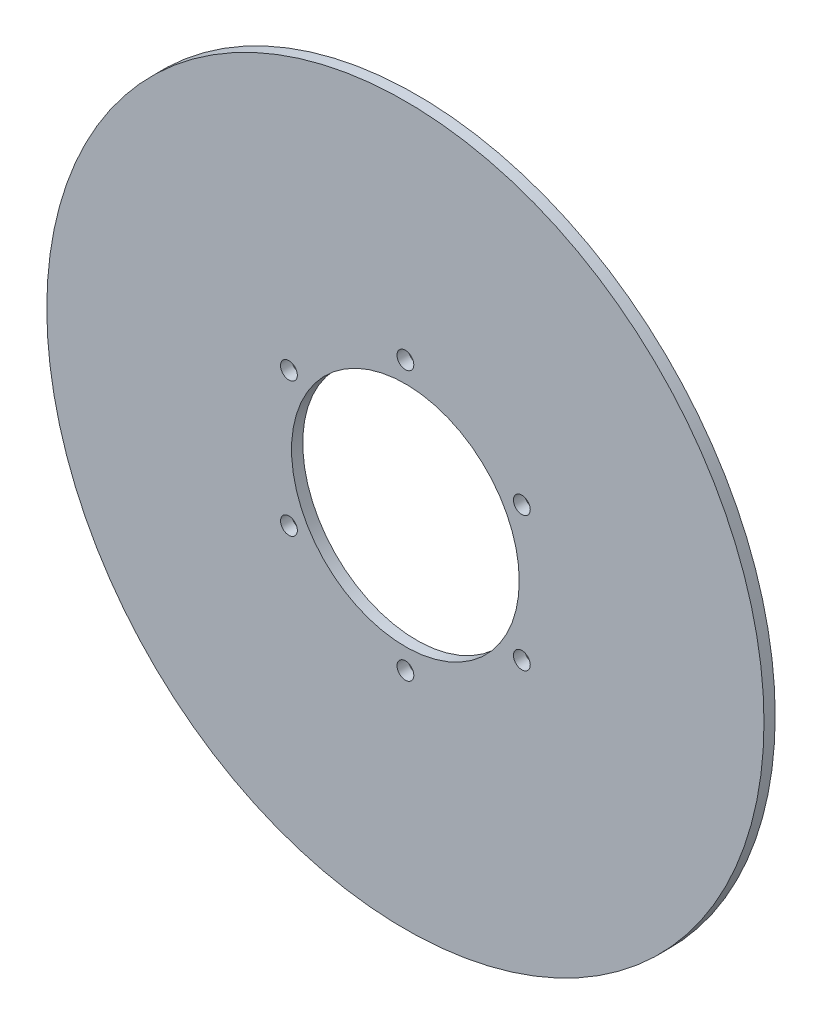
ISO-10303-21;
HEADER;
FILE_DESCRIPTION(('STEP AP214'),'2;1');
FILE_NAME('part.step','',(''),(''),'','','');
FILE_SCHEMA(('AUTOMOTIVE_DESIGN { 1 0 10303 214 1 1 1 1 }'));
ENDSEC;
DATA;
#1=APPLICATION_CONTEXT('core data for automotive mechanical design processes');
#2=APPLICATION_PROTOCOL_DEFINITION('international standard','automotive_design',2000,#1);
#3=PRODUCT_CONTEXT('',#1,'mechanical');
#4=PRODUCT('Part','Part','',(#3));
#5=PRODUCT_RELATED_PRODUCT_CATEGORY('part','',(#4));
#6=PRODUCT_DEFINITION_FORMATION('','',#4);
#7=PRODUCT_DEFINITION_CONTEXT('part definition',#1,'design');
#8=PRODUCT_DEFINITION('design','',#6,#7);
#9=PRODUCT_DEFINITION_SHAPE('','',#8);
#10=(LENGTH_UNIT() NAMED_UNIT(*) SI_UNIT(.MILLI.,.METRE.));
#11=(NAMED_UNIT(*) PLANE_ANGLE_UNIT() SI_UNIT($,.RADIAN.));
#12=(NAMED_UNIT(*) SI_UNIT($,.STERADIAN.) SOLID_ANGLE_UNIT());
#13=UNCERTAINTY_MEASURE_WITH_UNIT(LENGTH_MEASURE(1.E-05),#10,'distance_accuracy_value','');
#14=(GEOMETRIC_REPRESENTATION_CONTEXT(3) GLOBAL_UNCERTAINTY_ASSIGNED_CONTEXT((#13)) GLOBAL_UNIT_ASSIGNED_CONTEXT((#10,
#11,#12)) REPRESENTATION_CONTEXT('',''));
#15=CARTESIAN_POINT('',(0.,0.,0.));
#16=DIRECTION('',(0.,0.,1.));
#17=DIRECTION('',(1.,0.,0.));
#18=AXIS2_PLACEMENT_3D('',#15,#16,#17);
#19=CARTESIAN_POINT('',(0.,0.,1.5875));
#20=DIRECTION('',(0.,0.,1.));
#21=DIRECTION('',(1.,0.,0.));
#22=AXIS2_PLACEMENT_3D('',#19,#20,#21);
#23=PLANE('',#22);
#24=CARTESIAN_POINT('',(16.4977839420934,9.52500000000019,1.5875));
#25=DIRECTION('',(0.,0.,1.));
#26=DIRECTION('',(1.,0.,0.));
#27=AXIS2_PLACEMENT_3D('',#24,#25,#26);
#28=CIRCLE('',#27,1.190625);
#29=CARTESIAN_POINT('',(17.6884089420934,9.52500000000019,1.5875));
#30=VERTEX_POINT('',#29);
#31=EDGE_CURVE('E110',#30,#30,#28,.T.);
#32=ORIENTED_EDGE('',*,*,#31,.F.);
#33=EDGE_LOOP('',(#32));
#34=FACE_BOUND('',#33,.T.);
#35=CARTESIAN_POINT('',(16.4977839420936,-9.52499999999985,1.5875));
#36=DIRECTION('',(0.,0.,1.));
#37=DIRECTION('',(1.,0.,0.));
#38=AXIS2_PLACEMENT_3D('',#35,#36,#37);
#39=CIRCLE('',#38,1.190625);
#40=CARTESIAN_POINT('',(17.6884089420936,-9.52499999999985,1.5875));
#41=VERTEX_POINT('',#40);
#42=EDGE_CURVE('E71',#41,#41,#39,.T.);
#43=ORIENTED_EDGE('',*,*,#42,.F.);
#44=EDGE_LOOP('',(#43));
#45=FACE_BOUND('',#44,.T.);
#46=CARTESIAN_POINT('',(0.,-19.05,1.5875));
#47=DIRECTION('',(0.,0.,1.));
#48=DIRECTION('',(1.,0.,0.));
#49=AXIS2_PLACEMENT_3D('',#46,#47,#48);
#50=CIRCLE('',#49,1.190625);
#51=CARTESIAN_POINT('',(1.190625,-19.05,1.5875));
#52=VERTEX_POINT('',#51);
#53=EDGE_CURVE('E59',#52,#52,#50,.T.);
#54=ORIENTED_EDGE('',*,*,#53,.F.);
#55=EDGE_LOOP('',(#54));
#56=FACE_BOUND('',#55,.T.);
#57=CARTESIAN_POINT('',(-16.4977839420935,-9.52500000000008,1.5875));
#58=DIRECTION('',(0.,0.,1.));
#59=DIRECTION('',(1.,0.,0.));
#60=AXIS2_PLACEMENT_3D('',#57,#58,#59);
#61=CIRCLE('',#60,1.190625);
#62=CARTESIAN_POINT('',(-15.3071589420935,-9.52500000000008,1.5875));
#63=VERTEX_POINT('',#62);
#64=EDGE_CURVE('E58',#63,#63,#61,.T.);
#65=ORIENTED_EDGE('',*,*,#64,.F.);
#66=EDGE_LOOP('',(#65));
#67=FACE_BOUND('',#66,.T.);
#68=CARTESIAN_POINT('',(-16.4977839420936,9.52499999999996,1.5875));
#69=DIRECTION('',(0.,0.,1.));
#70=DIRECTION('',(1.,0.,0.));
#71=AXIS2_PLACEMENT_3D('',#68,#69,#70);
#72=CIRCLE('',#71,1.190625);
#73=CARTESIAN_POINT('',(-15.3071589420936,9.52499999999996,1.5875));
#74=VERTEX_POINT('',#73);
#75=EDGE_CURVE('E55',#74,#74,#72,.T.);
#76=ORIENTED_EDGE('',*,*,#75,.F.);
#77=EDGE_LOOP('',(#76));
#78=FACE_BOUND('',#77,.T.);
#79=CARTESIAN_POINT('',(0.,19.05,1.5875));
#80=DIRECTION('',(0.,0.,1.));
#81=DIRECTION('',(1.,0.,0.));
#82=AXIS2_PLACEMENT_3D('',#79,#80,#81);
#83=CIRCLE('',#82,1.190625);
#84=CARTESIAN_POINT('',(1.190625,19.05,1.5875));
#85=VERTEX_POINT('',#84);
#86=EDGE_CURVE('E52',#85,#85,#83,.T.);
#87=ORIENTED_EDGE('',*,*,#86,.F.);
#88=EDGE_LOOP('',(#87));
#89=FACE_BOUND('',#88,.T.);
#90=CARTESIAN_POINT('',(0.,0.,1.5875));
#91=DIRECTION('',(0.,0.,1.));
#92=DIRECTION('',(1.,0.,0.));
#93=AXIS2_PLACEMENT_3D('',#90,#91,#92);
#94=CIRCLE('',#93,50.8);
#95=CARTESIAN_POINT('',(50.8,0.,1.5875));
#96=VERTEX_POINT('',#95);
#97=EDGE_CURVE('E10',#96,#96,#94,.T.);
#98=ORIENTED_EDGE('',*,*,#97,.T.);
#99=EDGE_LOOP('',(#98));
#100=FACE_BOUND('',#99,.T.);
#101=CARTESIAN_POINT('',(0.,0.,1.5875));
#102=DIRECTION('',(0.,0.,1.));
#103=DIRECTION('',(1.,0.,0.));
#104=AXIS2_PLACEMENT_3D('',#101,#102,#103);
#105=CIRCLE('',#104,16.129);
#106=CARTESIAN_POINT('',(16.129,0.,1.5875));
#107=VERTEX_POINT('',#106);
#108=EDGE_CURVE('E43',#107,#107,#105,.T.);
#109=ORIENTED_EDGE('',*,*,#108,.F.);
#110=EDGE_LOOP('',(#109));
#111=FACE_BOUND('',#110,.T.);
#112=ADVANCED_FACE('F30',(#34,#45,#56,#67,#78,#89,#100,#111),#23,.T.);
#113=CARTESIAN_POINT('',(0.,0.,0.));
#114=DIRECTION('',(0.,0.,1.));
#115=DIRECTION('',(1.,0.,0.));
#116=AXIS2_PLACEMENT_3D('',#113,#114,#115);
#117=PLANE('',#116);
#118=CARTESIAN_POINT('',(16.4977839420934,9.52500000000019,0.));
#119=DIRECTION('',(0.,0.,1.));
#120=DIRECTION('',(1.,0.,0.));
#121=AXIS2_PLACEMENT_3D('',#118,#119,#120);
#122=CIRCLE('',#121,1.190625);
#123=CARTESIAN_POINT('',(17.6884089420934,9.52500000000019,0.));
#124=VERTEX_POINT('',#123);
#125=EDGE_CURVE('E34',#124,#124,#122,.T.);
#126=ORIENTED_EDGE('',*,*,#125,.T.);
#127=EDGE_LOOP('',(#126));
#128=FACE_BOUND('',#127,.T.);
#129=CARTESIAN_POINT('',(16.4977839420936,-9.52499999999985,0.));
#130=DIRECTION('',(0.,0.,1.));
#131=DIRECTION('',(1.,0.,0.));
#132=AXIS2_PLACEMENT_3D('',#129,#130,#131);
#133=CIRCLE('',#132,1.190625);
#134=CARTESIAN_POINT('',(17.6884089420936,-9.52499999999985,0.));
#135=VERTEX_POINT('',#134);
#136=EDGE_CURVE('E66',#135,#135,#133,.T.);
#137=ORIENTED_EDGE('',*,*,#136,.T.);
#138=EDGE_LOOP('',(#137));
#139=FACE_BOUND('',#138,.T.);
#140=CARTESIAN_POINT('',(0.,-19.05,0.));
#141=DIRECTION('',(0.,0.,1.));
#142=DIRECTION('',(1.,0.,0.));
#143=AXIS2_PLACEMENT_3D('',#140,#141,#142);
#144=CIRCLE('',#143,1.190625);
#145=CARTESIAN_POINT('',(1.190625,-19.05,0.));
#146=VERTEX_POINT('',#145);
#147=EDGE_CURVE('E56',#146,#146,#144,.T.);
#148=ORIENTED_EDGE('',*,*,#147,.T.);
#149=EDGE_LOOP('',(#148));
#150=FACE_BOUND('',#149,.T.);
#151=CARTESIAN_POINT('',(-16.4977839420935,-9.52500000000008,0.));
#152=DIRECTION('',(0.,0.,1.));
#153=DIRECTION('',(1.,0.,0.));
#154=AXIS2_PLACEMENT_3D('',#151,#152,#153);
#155=CIRCLE('',#154,1.190625);
#156=CARTESIAN_POINT('',(-15.3071589420935,-9.52500000000008,0.));
#157=VERTEX_POINT('',#156);
#158=EDGE_CURVE('E63',#157,#157,#155,.T.);
#159=ORIENTED_EDGE('',*,*,#158,.T.);
#160=EDGE_LOOP('',(#159));
#161=FACE_BOUND('',#160,.T.);
#162=CARTESIAN_POINT('',(-16.4977839420936,9.52499999999996,0.));
#163=DIRECTION('',(0.,0.,1.));
#164=DIRECTION('',(1.,0.,0.));
#165=AXIS2_PLACEMENT_3D('',#162,#163,#164);
#166=CIRCLE('',#165,1.190625);
#167=CARTESIAN_POINT('',(-15.3071589420936,9.52499999999996,0.));
#168=VERTEX_POINT('',#167);
#169=EDGE_CURVE('E53',#168,#168,#166,.T.);
#170=ORIENTED_EDGE('',*,*,#169,.T.);
#171=EDGE_LOOP('',(#170));
#172=FACE_BOUND('',#171,.T.);
#173=CARTESIAN_POINT('',(0.,19.05,0.));
#174=DIRECTION('',(0.,0.,1.));
#175=DIRECTION('',(1.,0.,0.));
#176=AXIS2_PLACEMENT_3D('',#173,#174,#175);
#177=CIRCLE('',#176,1.190625);
#178=CARTESIAN_POINT('',(1.190625,19.05,0.));
#179=VERTEX_POINT('',#178);
#180=EDGE_CURVE('E49',#179,#179,#177,.T.);
#181=ORIENTED_EDGE('',*,*,#180,.T.);
#182=EDGE_LOOP('',(#181));
#183=FACE_BOUND('',#182,.T.);
#184=CARTESIAN_POINT('',(0.,0.,0.));
#185=DIRECTION('',(0.,0.,1.));
#186=DIRECTION('',(1.,0.,0.));
#187=AXIS2_PLACEMENT_3D('',#184,#185,#186);
#188=CIRCLE('',#187,50.8);
#189=CARTESIAN_POINT('',(50.8,0.,0.));
#190=VERTEX_POINT('',#189);
#191=EDGE_CURVE('E38',#190,#190,#188,.T.);
#192=ORIENTED_EDGE('',*,*,#191,.F.);
#193=EDGE_LOOP('',(#192));
#194=FACE_BOUND('',#193,.T.);
#195=CARTESIAN_POINT('',(0.,0.,0.));
#196=DIRECTION('',(0.,0.,1.));
#197=DIRECTION('',(1.,0.,0.));
#198=AXIS2_PLACEMENT_3D('',#195,#196,#197);
#199=CIRCLE('',#198,16.129);
#200=CARTESIAN_POINT('',(16.129,0.,0.));
#201=VERTEX_POINT('',#200);
#202=EDGE_CURVE('E46',#201,#201,#199,.T.);
#203=ORIENTED_EDGE('',*,*,#202,.T.);
#204=EDGE_LOOP('',(#203));
#205=FACE_BOUND('',#204,.T.);
#206=ADVANCED_FACE('F86',(#128,#139,#150,#161,#172,#183,#194,#205),#117,.F.);
#207=CARTESIAN_POINT('',(0.,0.,1.5875));
#208=DIRECTION('',(0.,0.,-1.));
#209=DIRECTION('',(-1.,0.,0.));
#210=AXIS2_PLACEMENT_3D('',#207,#208,#209);
#211=CYLINDRICAL_SURFACE('',#210,50.8);
#212=ORIENTED_EDGE('',*,*,#97,.F.);
#213=EDGE_LOOP('',(#212));
#214=FACE_BOUND('',#213,.T.);
#215=ORIENTED_EDGE('',*,*,#191,.T.);
#216=EDGE_LOOP('',(#215));
#217=FACE_BOUND('',#216,.T.);
#218=ADVANCED_FACE('F32',(#214,#217),#211,.T.);
#219=CARTESIAN_POINT('',(0.,0.,1.5875));
#220=DIRECTION('',(0.,0.,-1.));
#221=DIRECTION('',(-1.,0.,0.));
#222=AXIS2_PLACEMENT_3D('',#219,#220,#221);
#223=CYLINDRICAL_SURFACE('',#222,16.129);
#224=ORIENTED_EDGE('',*,*,#108,.T.);
#225=EDGE_LOOP('',(#224));
#226=FACE_BOUND('',#225,.T.);
#227=ORIENTED_EDGE('',*,*,#202,.F.);
#228=EDGE_LOOP('',(#227));
#229=FACE_BOUND('',#228,.T.);
#230=ADVANCED_FACE('F88',(#226,#229),#223,.F.);
#231=CARTESIAN_POINT('',(0.,19.05,1.5875));
#232=DIRECTION('',(0.,0.,1.));
#233=DIRECTION('',(1.,0.,0.));
#234=AXIS2_PLACEMENT_3D('',#231,#232,#233);
#235=CYLINDRICAL_SURFACE('',#234,1.190625);
#236=ORIENTED_EDGE('',*,*,#86,.T.);
#237=EDGE_LOOP('',(#236));
#238=FACE_BOUND('',#237,.T.);
#239=ORIENTED_EDGE('',*,*,#180,.F.);
#240=EDGE_LOOP('',(#239));
#241=FACE_BOUND('',#240,.T.);
#242=ADVANCED_FACE('F90',(#238,#241),#235,.F.);
#243=CARTESIAN_POINT('',(-16.4977839420936,9.52499999999996,1.5875));
#244=DIRECTION('',(0.,0.,1.));
#245=DIRECTION('',(1.,0.,0.));
#246=AXIS2_PLACEMENT_3D('',#243,#244,#245);
#247=CYLINDRICAL_SURFACE('',#246,1.190625);
#248=ORIENTED_EDGE('',*,*,#75,.T.);
#249=EDGE_LOOP('',(#248));
#250=FACE_BOUND('',#249,.T.);
#251=ORIENTED_EDGE('',*,*,#169,.F.);
#252=EDGE_LOOP('',(#251));
#253=FACE_BOUND('',#252,.T.);
#254=ADVANCED_FACE('F96',(#250,#253),#247,.F.);
#255=CARTESIAN_POINT('',(-16.4977839420935,-9.52500000000008,1.5875));
#256=DIRECTION('',(0.,0.,1.));
#257=DIRECTION('',(1.,0.,0.));
#258=AXIS2_PLACEMENT_3D('',#255,#256,#257);
#259=CYLINDRICAL_SURFACE('',#258,1.190625);
#260=ORIENTED_EDGE('',*,*,#64,.T.);
#261=EDGE_LOOP('',(#260));
#262=FACE_BOUND('',#261,.T.);
#263=ORIENTED_EDGE('',*,*,#158,.F.);
#264=EDGE_LOOP('',(#263));
#265=FACE_BOUND('',#264,.T.);
#266=ADVANCED_FACE('F130',(#262,#265),#259,.F.);
#267=CARTESIAN_POINT('',(0.,-19.05,1.5875));
#268=DIRECTION('',(0.,0.,1.));
#269=DIRECTION('',(1.,0.,0.));
#270=AXIS2_PLACEMENT_3D('',#267,#268,#269);
#271=CYLINDRICAL_SURFACE('',#270,1.190625);
#272=ORIENTED_EDGE('',*,*,#53,.T.);
#273=EDGE_LOOP('',(#272));
#274=FACE_BOUND('',#273,.T.);
#275=ORIENTED_EDGE('',*,*,#147,.F.);
#276=EDGE_LOOP('',(#275));
#277=FACE_BOUND('',#276,.T.);
#278=ADVANCED_FACE('F137',(#274,#277),#271,.F.);
#279=CARTESIAN_POINT('',(16.4977839420936,-9.52499999999985,1.5875));
#280=DIRECTION('',(0.,0.,1.));
#281=DIRECTION('',(1.,0.,0.));
#282=AXIS2_PLACEMENT_3D('',#279,#280,#281);
#283=CYLINDRICAL_SURFACE('',#282,1.190625);
#284=ORIENTED_EDGE('',*,*,#42,.T.);
#285=EDGE_LOOP('',(#284));
#286=FACE_BOUND('',#285,.T.);
#287=ORIENTED_EDGE('',*,*,#136,.F.);
#288=EDGE_LOOP('',(#287));
#289=FACE_BOUND('',#288,.T.);
#290=ADVANCED_FACE('F143',(#286,#289),#283,.F.);
#291=CARTESIAN_POINT('',(16.4977839420934,9.52500000000019,1.5875));
#292=DIRECTION('',(0.,0.,1.));
#293=DIRECTION('',(1.,0.,0.));
#294=AXIS2_PLACEMENT_3D('',#291,#292,#293);
#295=CYLINDRICAL_SURFACE('',#294,1.190625);
#296=ORIENTED_EDGE('',*,*,#31,.T.);
#297=EDGE_LOOP('',(#296));
#298=FACE_BOUND('',#297,.T.);
#299=ORIENTED_EDGE('',*,*,#125,.F.);
#300=EDGE_LOOP('',(#299));
#301=FACE_BOUND('',#300,.T.);
#302=ADVANCED_FACE('F146',(#298,#301),#295,.F.);
#303=CLOSED_SHELL('',(#112,#206,#218,#230,#242,#254,#266,#278,#290,#302));
#304=MANIFOLD_SOLID_BREP('B2',#303);
#305=ADVANCED_BREP_SHAPE_REPRESENTATION('',(#18,#304),#14);
#306=SHAPE_DEFINITION_REPRESENTATION(#9,#305);
ENDSEC;
END-ISO-10303-21;
